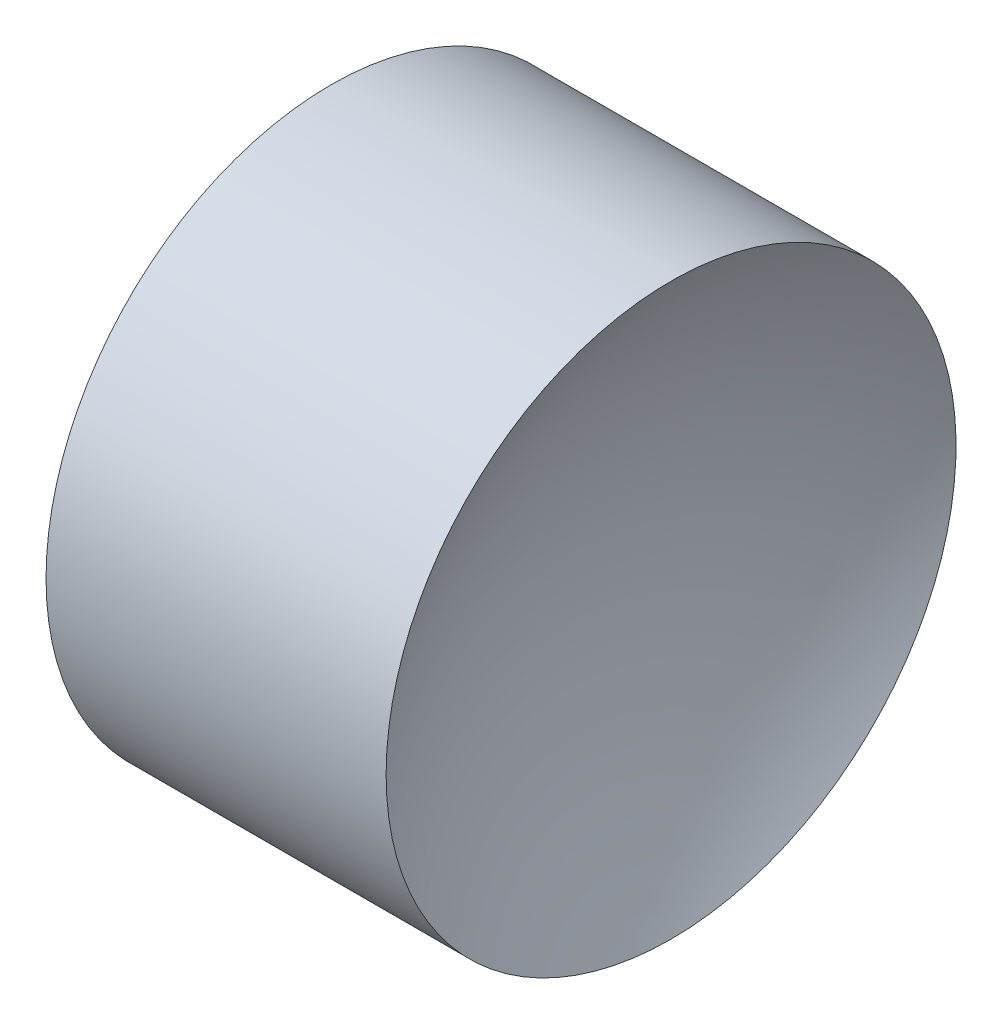
ISO-10303-21;
HEADER;
FILE_DESCRIPTION(('STEP AP214'),'2;1');
FILE_NAME('part.step','',(''),(''),'','','');
FILE_SCHEMA(('AUTOMOTIVE_DESIGN { 1 0 10303 214 1 1 1 1 }'));
ENDSEC;
DATA;
#1=APPLICATION_CONTEXT('core data for automotive mechanical design processes');
#2=APPLICATION_PROTOCOL_DEFINITION('international standard','automotive_design',2000,#1);
#3=PRODUCT_CONTEXT('',#1,'mechanical');
#4=PRODUCT('Part','Part','',(#3));
#5=PRODUCT_RELATED_PRODUCT_CATEGORY('part','',(#4));
#6=PRODUCT_DEFINITION_FORMATION('','',#4);
#7=PRODUCT_DEFINITION_CONTEXT('part definition',#1,'design');
#8=PRODUCT_DEFINITION('design','',#6,#7);
#9=PRODUCT_DEFINITION_SHAPE('','',#8);
#10=(LENGTH_UNIT() NAMED_UNIT(*) SI_UNIT(.MILLI.,.METRE.));
#11=(NAMED_UNIT(*) PLANE_ANGLE_UNIT() SI_UNIT($,.RADIAN.));
#12=(NAMED_UNIT(*) SI_UNIT($,.STERADIAN.) SOLID_ANGLE_UNIT());
#13=UNCERTAINTY_MEASURE_WITH_UNIT(LENGTH_MEASURE(1.E-05),#10,'distance_accuracy_value','');
#14=(GEOMETRIC_REPRESENTATION_CONTEXT(3) GLOBAL_UNCERTAINTY_ASSIGNED_CONTEXT((#13)) GLOBAL_UNIT_ASSIGNED_CONTEXT((#10,
#11,#12)) REPRESENTATION_CONTEXT('',''));
#15=CARTESIAN_POINT('',(0.,0.,0.));
#16=DIRECTION('',(0.,0.,1.));
#17=DIRECTION('',(1.,0.,0.));
#18=AXIS2_PLACEMENT_3D('',#15,#16,#17);
#19=CARTESIAN_POINT('',(16.9318528717462,13.0445205745975,0.));
#20=DIRECTION('',(-1.,0.,0.));
#21=DIRECTION('',(0.,1.,0.));
#22=AXIS2_PLACEMENT_3D('',#19,#20,#21);
#23=SPHERICAL_SURFACE('',#22,6.08);
#24=CARTESIAN_POINT('',(22.1322278582255,13.0445205745975,0.));
#25=DIRECTION('',(-1.,0.,0.));
#26=DIRECTION('',(0.,0.,1.));
#27=AXIS2_PLACEMENT_3D('',#24,#25,#26);
#28=CIRCLE('',#27,3.15);
#29=CARTESIAN_POINT('',(22.1322278582255,13.0445205745975,3.15));
#30=VERTEX_POINT('',#29);
#31=EDGE_CURVE('E41',#30,#30,#28,.T.);
#32=ORIENTED_EDGE('',*,*,#31,.T.);
#33=EDGE_LOOP('',(#32));
#34=FACE_BOUND('',#33,.T.);
#35=ADVANCED_FACE('F35',(#34),#23,.F.);
#36=CARTESIAN_POINT('',(31.0918528717462,13.0445205745975,0.));
#37=DIRECTION('',(-1.,0.,0.));
#38=DIRECTION('',(0.,-1.,0.));
#39=AXIS2_PLACEMENT_3D('',#36,#37,#38);
#40=SPHERICAL_SURFACE('',#39,6.08);
#41=CARTESIAN_POINT('',(25.8914778852668,13.0445205745975,0.));
#42=DIRECTION('',(-1.,0.,0.));
#43=DIRECTION('',(0.,0.,1.));
#44=AXIS2_PLACEMENT_3D('',#41,#42,#43);
#45=CIRCLE('',#44,3.15);
#46=CARTESIAN_POINT('',(25.8914778852668,13.0445205745975,3.15));
#47=VERTEX_POINT('',#46);
#48=EDGE_CURVE('E10',#47,#47,#45,.T.);
#49=ORIENTED_EDGE('',*,*,#48,.F.);
#50=EDGE_LOOP('',(#49));
#51=FACE_BOUND('',#50,.T.);
#52=ADVANCED_FACE('F50',(#51),#40,.F.);
#53=CARTESIAN_POINT('',(21.2249305570684,13.0445205745975,0.));
#54=DIRECTION('',(-1.,0.,0.));
#55=DIRECTION('',(0.,0.,1.));
#56=AXIS2_PLACEMENT_3D('',#53,#54,#55);
#57=CYLINDRICAL_SURFACE('',#56,3.15);
#58=ORIENTED_EDGE('',*,*,#31,.F.);
#59=EDGE_LOOP('',(#58));
#60=FACE_BOUND('',#59,.T.);
#61=ORIENTED_EDGE('',*,*,#48,.T.);
#62=EDGE_LOOP('',(#61));
#63=FACE_BOUND('',#62,.T.);
#64=ADVANCED_FACE('F48',(#60,#63),#57,.T.);
#65=CLOSED_SHELL('',(#35,#52,#64));
#66=MANIFOLD_SOLID_BREP('B2',#65);
#67=ADVANCED_BREP_SHAPE_REPRESENTATION('',(#18,#66),#14);
#68=SHAPE_DEFINITION_REPRESENTATION(#9,#67);
ENDSEC;
END-ISO-10303-21;
